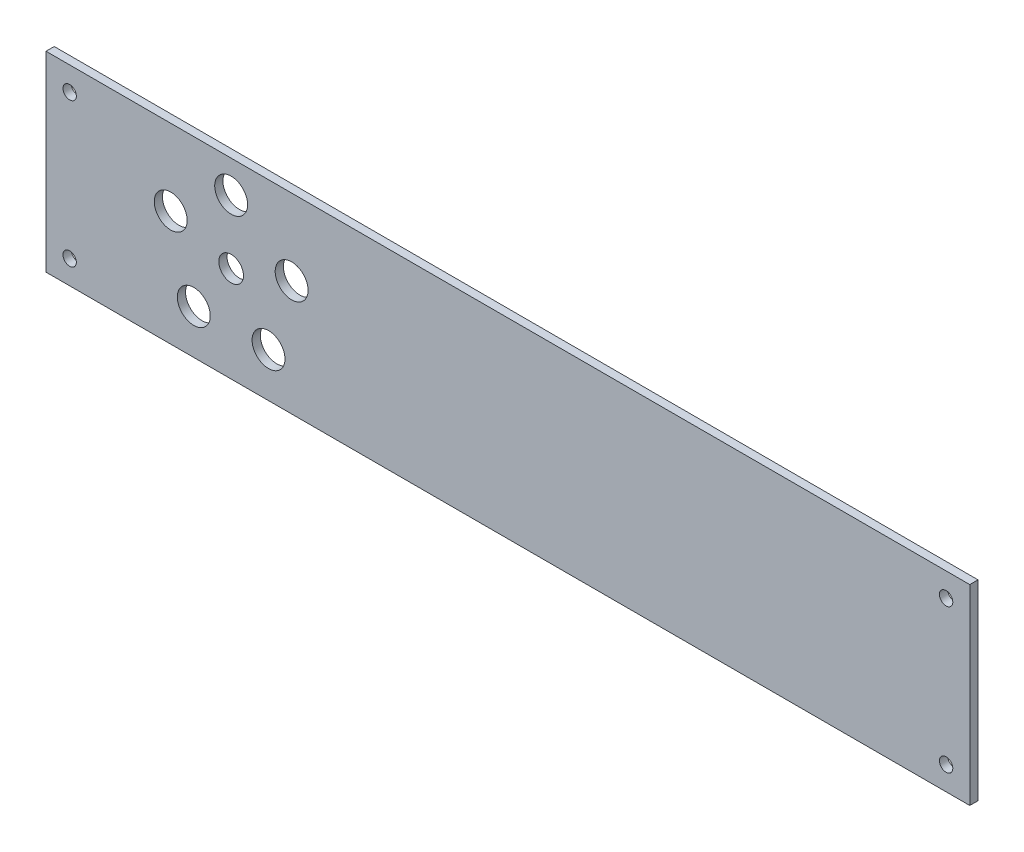
ISO-10303-21;
HEADER;
FILE_DESCRIPTION(('STEP AP214'),'2;1');
FILE_NAME('part.step','',(''),(''),'','','');
FILE_SCHEMA(('AUTOMOTIVE_DESIGN { 1 0 10303 214 1 1 1 1 }'));
ENDSEC;
DATA;
#1=APPLICATION_CONTEXT('core data for automotive mechanical design processes');
#2=APPLICATION_PROTOCOL_DEFINITION('international standard','automotive_design',2000,#1);
#3=PRODUCT_CONTEXT('',#1,'mechanical');
#4=PRODUCT('Part','Part','',(#3));
#5=PRODUCT_RELATED_PRODUCT_CATEGORY('part','',(#4));
#6=PRODUCT_DEFINITION_FORMATION('','',#4);
#7=PRODUCT_DEFINITION_CONTEXT('part definition',#1,'design');
#8=PRODUCT_DEFINITION('design','',#6,#7);
#9=PRODUCT_DEFINITION_SHAPE('','',#8);
#10=(LENGTH_UNIT() NAMED_UNIT(*) SI_UNIT(.MILLI.,.METRE.));
#11=(NAMED_UNIT(*) PLANE_ANGLE_UNIT() SI_UNIT($,.RADIAN.));
#12=(NAMED_UNIT(*) SI_UNIT($,.STERADIAN.) SOLID_ANGLE_UNIT());
#13=UNCERTAINTY_MEASURE_WITH_UNIT(LENGTH_MEASURE(1.E-05),#10,'distance_accuracy_value','');
#14=(GEOMETRIC_REPRESENTATION_CONTEXT(3) GLOBAL_UNCERTAINTY_ASSIGNED_CONTEXT((#13)) GLOBAL_UNIT_ASSIGNED_CONTEXT((#10,
#11,#12)) REPRESENTATION_CONTEXT('',''));
#15=CARTESIAN_POINT('',(0.,0.,0.));
#16=DIRECTION('',(0.,0.,1.));
#17=DIRECTION('',(1.,0.,0.));
#18=AXIS2_PLACEMENT_3D('',#15,#16,#17);
#19=CARTESIAN_POINT('',(0.,0.,4.));
#20=DIRECTION('',(0.,0.,1.));
#21=DIRECTION('',(1.,0.,0.));
#22=AXIS2_PLACEMENT_3D('',#19,#20,#21);
#23=PLANE('',#22);
#24=CARTESIAN_POINT('',(-377.163563200134,21.4999999999999,4.));
#25=DIRECTION('',(0.,0.,1.));
#26=DIRECTION('',(1.,0.,0.));
#27=AXIS2_PLACEMENT_3D('',#24,#25,#26);
#28=CIRCLE('',#27,7.99999999999998);
#29=CARTESIAN_POINT('',(-369.163563200134,21.4999999999999,4.));
#30=VERTEX_POINT('',#29);
#31=EDGE_CURVE('E211',#30,#30,#28,.T.);
#32=ORIENTED_EDGE('',*,*,#31,.F.);
#33=EDGE_LOOP('',(#32));
#34=FACE_BOUND('',#33,.T.);
#35=CARTESIAN_POINT('',(-329.610737385376,56.0491502812527,4.));
#36=DIRECTION('',(0.,0.,1.));
#37=DIRECTION('',(1.,0.,0.));
#38=AXIS2_PLACEMENT_3D('',#35,#36,#37);
#39=CIRCLE('',#38,7.99999999999998);
#40=CARTESIAN_POINT('',(-321.610737385376,56.0491502812527,4.));
#41=VERTEX_POINT('',#40);
#42=EDGE_CURVE('E240',#41,#41,#39,.T.);
#43=ORIENTED_EDGE('',*,*,#42,.F.);
#44=EDGE_LOOP('',(#43));
#45=FACE_BOUND('',#44,.T.);
#46=CARTESIAN_POINT('',(-11.5,11.5000000000001,4.));
#47=DIRECTION('',(0.,0.,1.));
#48=DIRECTION('',(1.,0.,0.));
#49=AXIS2_PLACEMENT_3D('',#46,#47,#48);
#50=CIRCLE('',#49,3.25);
#51=CARTESIAN_POINT('',(-8.24999999999996,11.5000000000001,4.));
#52=VERTEX_POINT('',#51);
#53=EDGE_CURVE('E191',#52,#52,#50,.T.);
#54=ORIENTED_EDGE('',*,*,#53,.F.);
#55=EDGE_LOOP('',(#54));
#56=FACE_BOUND('',#55,.T.);
#57=CARTESIAN_POINT('',(-359.,77.4016994374947,4.));
#58=DIRECTION('',(0.,0.,1.));
#59=DIRECTION('',(1.,0.,0.));
#60=AXIS2_PLACEMENT_3D('',#57,#58,#59);
#61=CIRCLE('',#60,7.99999999999999);
#62=CARTESIAN_POINT('',(-351.,77.4016994374947,4.));
#63=VERTEX_POINT('',#62);
#64=EDGE_CURVE('E437',#63,#63,#61,.T.);
#65=ORIENTED_EDGE('',*,*,#64,.F.);
#66=EDGE_LOOP('',(#65));
#67=FACE_BOUND('',#66,.T.);
#68=CARTESIAN_POINT('',(-437.5,81.4999999999999,4.));
#69=DIRECTION('',(0.,0.,1.));
#70=DIRECTION('',(1.,0.,0.));
#71=AXIS2_PLACEMENT_3D('',#68,#69,#70);
#72=CIRCLE('',#71,3.24999999999995);
#73=CARTESIAN_POINT('',(-434.25,81.4999999999999,4.));
#74=VERTEX_POINT('',#73);
#75=EDGE_CURVE('E117',#74,#74,#72,.T.);
#76=ORIENTED_EDGE('',*,*,#75,.F.);
#77=EDGE_LOOP('',(#76));
#78=FACE_BOUND('',#77,.T.);
#79=DIRECTION('',(0.,1.,0.));
#80=VECTOR('',#79,1.);
#81=CARTESIAN_POINT('',(0.,0.,4.));
#82=LINE('',#81,#80);
#83=CARTESIAN_POINT('',(0.,0.,4.));
#84=VERTEX_POINT('',#83);
#85=CARTESIAN_POINT('',(0.,92.9999999999999,4.));
#86=VERTEX_POINT('',#85);
#87=EDGE_CURVE('E97',#84,#86,#82,.T.);
#88=ORIENTED_EDGE('',*,*,#87,.T.);
#89=DIRECTION('',(-1.,0.,0.));
#90=VECTOR('',#89,1.);
#91=CARTESIAN_POINT('',(0.,92.9999999999999,4.));
#92=LINE('',#91,#90);
#93=CARTESIAN_POINT('',(-449.,92.9999999999999,4.));
#94=VERTEX_POINT('',#93);
#95=EDGE_CURVE('E92',#86,#94,#92,.T.);
#96=ORIENTED_EDGE('',*,*,#95,.T.);
#97=DIRECTION('',(0.,-1.,0.));
#98=VECTOR('',#97,1.);
#99=CARTESIAN_POINT('',(-449.,0.,4.));
#100=LINE('',#99,#98);
#101=CARTESIAN_POINT('',(-449.,0.,4.));
#102=VERTEX_POINT('',#101);
#103=EDGE_CURVE('E95',#94,#102,#100,.T.);
#104=ORIENTED_EDGE('',*,*,#103,.T.);
#105=DIRECTION('',(1.,0.,0.));
#106=VECTOR('',#105,1.);
#107=CARTESIAN_POINT('',(0.,0.,4.));
#108=LINE('',#107,#106);
#109=EDGE_CURVE('E61',#102,#84,#108,.T.);
#110=ORIENTED_EDGE('',*,*,#109,.T.);
#111=EDGE_LOOP('',(#88,#96,#104,#110));
#112=FACE_BOUND('',#111,.T.);
#113=CARTESIAN_POINT('',(-388.389262614624,56.0491502812526,4.));
#114=DIRECTION('',(0.,0.,1.));
#115=DIRECTION('',(1.,0.,0.));
#116=AXIS2_PLACEMENT_3D('',#113,#114,#115);
#117=CIRCLE('',#116,7.99999999999998);
#118=CARTESIAN_POINT('',(-380.389262614624,56.0491502812526,4.));
#119=VERTEX_POINT('',#118);
#120=EDGE_CURVE('E139',#119,#119,#117,.T.);
#121=ORIENTED_EDGE('',*,*,#120,.F.);
#122=EDGE_LOOP('',(#121));
#123=FACE_BOUND('',#122,.T.);
#124=CARTESIAN_POINT('',(-11.5,81.4999999999998,4.));
#125=DIRECTION('',(0.,0.,1.));
#126=DIRECTION('',(-1.,0.,0.));
#127=AXIS2_PLACEMENT_3D('',#124,#125,#126);
#128=CIRCLE('',#127,3.25);
#129=CARTESIAN_POINT('',(-14.75,81.4999999999998,4.));
#130=VERTEX_POINT('',#129);
#131=EDGE_CURVE('E178',#130,#130,#128,.T.);
#132=ORIENTED_EDGE('',*,*,#131,.F.);
#133=EDGE_LOOP('',(#132));
#134=FACE_BOUND('',#133,.T.);
#135=CARTESIAN_POINT('',(-437.5,11.4999999999999,4.));
#136=DIRECTION('',(0.,0.,1.));
#137=DIRECTION('',(-1.,0.,0.));
#138=AXIS2_PLACEMENT_3D('',#135,#136,#137);
#139=CIRCLE('',#138,3.24999999999995);
#140=CARTESIAN_POINT('',(-440.75,11.4999999999999,4.));
#141=VERTEX_POINT('',#140);
#142=EDGE_CURVE('E159',#141,#141,#139,.T.);
#143=ORIENTED_EDGE('',*,*,#142,.F.);
#144=EDGE_LOOP('',(#143));
#145=FACE_BOUND('',#144,.T.);
#146=CARTESIAN_POINT('',(-340.836436799866,21.5,4.));
#147=DIRECTION('',(0.,0.,1.));
#148=DIRECTION('',(1.,0.,0.));
#149=AXIS2_PLACEMENT_3D('',#146,#147,#148);
#150=CIRCLE('',#149,8.00000000000003);
#151=CARTESIAN_POINT('',(-332.836436799866,21.5,4.));
#152=VERTEX_POINT('',#151);
#153=EDGE_CURVE('E225',#152,#152,#150,.T.);
#154=ORIENTED_EDGE('',*,*,#153,.F.);
#155=EDGE_LOOP('',(#154));
#156=FACE_BOUND('',#155,.T.);
#157=CARTESIAN_POINT('',(-359.,46.4999999999999,4.));
#158=DIRECTION('',(0.,0.,1.));
#159=DIRECTION('',(1.,0.,0.));
#160=AXIS2_PLACEMENT_3D('',#157,#158,#159);
#161=CIRCLE('',#160,5.99999999999999);
#162=CARTESIAN_POINT('',(-353.,46.4999999999999,4.));
#163=VERTEX_POINT('',#162);
#164=EDGE_CURVE('E234',#163,#163,#161,.T.);
#165=ORIENTED_EDGE('',*,*,#164,.F.);
#166=EDGE_LOOP('',(#165));
#167=FACE_BOUND('',#166,.T.);
#168=ADVANCED_FACE('F43',(#34,#45,#56,#67,#78,#112,#123,#134,#145,#156,#167),#23,.T.);
#169=CARTESIAN_POINT('',(0.,0.,0.));
#170=DIRECTION('',(0.,0.,1.));
#171=DIRECTION('',(1.,0.,0.));
#172=AXIS2_PLACEMENT_3D('',#169,#170,#171);
#173=PLANE('',#172);
#174=DIRECTION('',(0.,1.,0.));
#175=VECTOR('',#174,1.);
#176=CARTESIAN_POINT('',(0.,0.,0.));
#177=LINE('',#176,#175);
#178=CARTESIAN_POINT('',(0.,0.,0.));
#179=VERTEX_POINT('',#178);
#180=CARTESIAN_POINT('',(0.,92.9999999999999,0.));
#181=VERTEX_POINT('',#180);
#182=EDGE_CURVE('E113',#179,#181,#177,.T.);
#183=ORIENTED_EDGE('',*,*,#182,.F.);
#184=DIRECTION('',(1.,0.,0.));
#185=VECTOR('',#184,1.);
#186=CARTESIAN_POINT('',(0.,0.,0.));
#187=LINE('',#186,#185);
#188=CARTESIAN_POINT('',(-449.,0.,0.));
#189=VERTEX_POINT('',#188);
#190=EDGE_CURVE('E85',#189,#179,#187,.T.);
#191=ORIENTED_EDGE('',*,*,#190,.F.);
#192=DIRECTION('',(0.,-1.,0.));
#193=VECTOR('',#192,1.);
#194=CARTESIAN_POINT('',(-449.,0.,0.));
#195=LINE('',#194,#193);
#196=CARTESIAN_POINT('',(-449.,92.9999999999999,0.));
#197=VERTEX_POINT('',#196);
#198=EDGE_CURVE('E79',#197,#189,#195,.T.);
#199=ORIENTED_EDGE('',*,*,#198,.F.);
#200=DIRECTION('',(-1.,0.,0.));
#201=VECTOR('',#200,1.);
#202=CARTESIAN_POINT('',(0.,92.9999999999999,0.));
#203=LINE('',#202,#201);
#204=EDGE_CURVE('E102',#181,#197,#203,.T.);
#205=ORIENTED_EDGE('',*,*,#204,.F.);
#206=EDGE_LOOP('',(#183,#191,#199,#205));
#207=FACE_BOUND('',#206,.T.);
#208=CARTESIAN_POINT('',(-437.5,81.4999999999999,0.));
#209=DIRECTION('',(0.,0.,1.));
#210=DIRECTION('',(1.,0.,0.));
#211=AXIS2_PLACEMENT_3D('',#208,#209,#210);
#212=CIRCLE('',#211,3.24999999999995);
#213=CARTESIAN_POINT('',(-434.25,81.4999999999999,0.));
#214=VERTEX_POINT('',#213);
#215=EDGE_CURVE('E135',#214,#214,#212,.T.);
#216=ORIENTED_EDGE('',*,*,#215,.T.);
#217=EDGE_LOOP('',(#216));
#218=FACE_BOUND('',#217,.T.);
#219=CARTESIAN_POINT('',(-388.389262614624,56.0491502812526,0.));
#220=DIRECTION('',(0.,0.,1.));
#221=DIRECTION('',(1.,0.,0.));
#222=AXIS2_PLACEMENT_3D('',#219,#220,#221);
#223=CIRCLE('',#222,7.99999999999998);
#224=CARTESIAN_POINT('',(-380.389262614624,56.0491502812526,0.));
#225=VERTEX_POINT('',#224);
#226=EDGE_CURVE('E144',#225,#225,#223,.T.);
#227=ORIENTED_EDGE('',*,*,#226,.T.);
#228=EDGE_LOOP('',(#227));
#229=FACE_BOUND('',#228,.T.);
#230=CARTESIAN_POINT('',(-359.,77.4016994374947,0.));
#231=DIRECTION('',(0.,0.,1.));
#232=DIRECTION('',(1.,0.,0.));
#233=AXIS2_PLACEMENT_3D('',#230,#231,#232);
#234=CIRCLE('',#233,7.99999999999999);
#235=CARTESIAN_POINT('',(-351.,77.4016994374947,0.));
#236=VERTEX_POINT('',#235);
#237=EDGE_CURVE('E184',#236,#236,#234,.T.);
#238=ORIENTED_EDGE('',*,*,#237,.T.);
#239=EDGE_LOOP('',(#238));
#240=FACE_BOUND('',#239,.T.);
#241=CARTESIAN_POINT('',(-11.5,81.4999999999998,0.));
#242=DIRECTION('',(0.,0.,1.));
#243=DIRECTION('',(-1.,0.,0.));
#244=AXIS2_PLACEMENT_3D('',#241,#242,#243);
#245=CIRCLE('',#244,3.25);
#246=CARTESIAN_POINT('',(-14.75,81.4999999999998,0.));
#247=VERTEX_POINT('',#246);
#248=EDGE_CURVE('E185',#247,#247,#245,.T.);
#249=ORIENTED_EDGE('',*,*,#248,.T.);
#250=EDGE_LOOP('',(#249));
#251=FACE_BOUND('',#250,.T.);
#252=CARTESIAN_POINT('',(-11.5,11.5000000000001,0.));
#253=DIRECTION('',(0.,0.,1.));
#254=DIRECTION('',(1.,0.,0.));
#255=AXIS2_PLACEMENT_3D('',#252,#253,#254);
#256=CIRCLE('',#255,3.25);
#257=CARTESIAN_POINT('',(-8.24999999999996,11.5000000000001,0.));
#258=VERTEX_POINT('',#257);
#259=EDGE_CURVE('E165',#258,#258,#256,.T.);
#260=ORIENTED_EDGE('',*,*,#259,.T.);
#261=EDGE_LOOP('',(#260));
#262=FACE_BOUND('',#261,.T.);
#263=CARTESIAN_POINT('',(-437.5,11.4999999999999,0.));
#264=DIRECTION('',(0.,0.,1.));
#265=DIRECTION('',(-1.,0.,0.));
#266=AXIS2_PLACEMENT_3D('',#263,#264,#265);
#267=CIRCLE('',#266,3.24999999999995);
#268=CARTESIAN_POINT('',(-440.75,11.4999999999999,0.));
#269=VERTEX_POINT('',#268);
#270=EDGE_CURVE('E166',#269,#269,#267,.T.);
#271=ORIENTED_EDGE('',*,*,#270,.T.);
#272=EDGE_LOOP('',(#271));
#273=FACE_BOUND('',#272,.T.);
#274=CARTESIAN_POINT('',(-329.610737385376,56.0491502812527,0.));
#275=DIRECTION('',(0.,0.,1.));
#276=DIRECTION('',(1.,0.,0.));
#277=AXIS2_PLACEMENT_3D('',#274,#275,#276);
#278=CIRCLE('',#277,7.99999999999998);
#279=CARTESIAN_POINT('',(-321.610737385376,56.0491502812527,0.));
#280=VERTEX_POINT('',#279);
#281=EDGE_CURVE('E167',#280,#280,#278,.T.);
#282=ORIENTED_EDGE('',*,*,#281,.T.);
#283=EDGE_LOOP('',(#282));
#284=FACE_BOUND('',#283,.T.);
#285=CARTESIAN_POINT('',(-340.836436799866,21.5,0.));
#286=DIRECTION('',(0.,0.,1.));
#287=DIRECTION('',(1.,0.,0.));
#288=AXIS2_PLACEMENT_3D('',#285,#286,#287);
#289=CIRCLE('',#288,8.00000000000003);
#290=CARTESIAN_POINT('',(-332.836436799866,21.5,0.));
#291=VERTEX_POINT('',#290);
#292=EDGE_CURVE('E217',#291,#291,#289,.T.);
#293=ORIENTED_EDGE('',*,*,#292,.T.);
#294=EDGE_LOOP('',(#293));
#295=FACE_BOUND('',#294,.T.);
#296=CARTESIAN_POINT('',(-377.163563200134,21.4999999999999,0.));
#297=DIRECTION('',(0.,0.,1.));
#298=DIRECTION('',(1.,0.,0.));
#299=AXIS2_PLACEMENT_3D('',#296,#297,#298);
#300=CIRCLE('',#299,7.99999999999998);
#301=CARTESIAN_POINT('',(-369.163563200134,21.4999999999999,0.));
#302=VERTEX_POINT('',#301);
#303=EDGE_CURVE('E218',#302,#302,#300,.T.);
#304=ORIENTED_EDGE('',*,*,#303,.T.);
#305=EDGE_LOOP('',(#304));
#306=FACE_BOUND('',#305,.T.);
#307=CARTESIAN_POINT('',(-359.,46.4999999999999,0.));
#308=DIRECTION('',(0.,0.,1.));
#309=DIRECTION('',(1.,0.,0.));
#310=AXIS2_PLACEMENT_3D('',#307,#308,#309);
#311=CIRCLE('',#310,5.99999999999999);
#312=CARTESIAN_POINT('',(-353.,46.4999999999999,0.));
#313=VERTEX_POINT('',#312);
#314=EDGE_CURVE('E219',#313,#313,#311,.T.);
#315=ORIENTED_EDGE('',*,*,#314,.T.);
#316=EDGE_LOOP('',(#315));
#317=FACE_BOUND('',#316,.T.);
#318=ADVANCED_FACE('F130',(#207,#218,#229,#240,#251,#262,#273,#284,#295,#306,#317),#173,.F.);
#319=CARTESIAN_POINT('',(0.,0.,4.));
#320=DIRECTION('',(-1.,0.,0.));
#321=DIRECTION('',(0.,0.,1.));
#322=AXIS2_PLACEMENT_3D('',#319,#320,#321);
#323=PLANE('',#322);
#324=ORIENTED_EDGE('',*,*,#182,.T.);
#325=DIRECTION('',(0.,0.,-1.));
#326=VECTOR('',#325,1.);
#327=CARTESIAN_POINT('',(0.,92.9999999999999,4.));
#328=LINE('',#327,#326);
#329=EDGE_CURVE('E12',#86,#181,#328,.T.);
#330=ORIENTED_EDGE('',*,*,#329,.F.);
#331=ORIENTED_EDGE('',*,*,#87,.F.);
#332=DIRECTION('',(0.,0.,-1.));
#333=VECTOR('',#332,1.);
#334=CARTESIAN_POINT('',(0.,0.,4.));
#335=LINE('',#334,#333);
#336=EDGE_CURVE('E109',#84,#179,#335,.T.);
#337=ORIENTED_EDGE('',*,*,#336,.T.);
#338=EDGE_LOOP('',(#324,#330,#331,#337));
#339=FACE_BOUND('',#338,.T.);
#340=ADVANCED_FACE('F45',(#339),#323,.F.);
#341=CARTESIAN_POINT('',(0.,92.9999999999999,4.));
#342=DIRECTION('',(0.,-1.,0.));
#343=DIRECTION('',(1.,0.,0.));
#344=AXIS2_PLACEMENT_3D('',#341,#342,#343);
#345=PLANE('',#344);
#346=ORIENTED_EDGE('',*,*,#204,.T.);
#347=DIRECTION('',(0.,0.,-1.));
#348=VECTOR('',#347,1.);
#349=CARTESIAN_POINT('',(-449.,92.9999999999999,4.));
#350=LINE('',#349,#348);
#351=EDGE_CURVE('E53',#94,#197,#350,.T.);
#352=ORIENTED_EDGE('',*,*,#351,.F.);
#353=ORIENTED_EDGE('',*,*,#95,.F.);
#354=ORIENTED_EDGE('',*,*,#329,.T.);
#355=EDGE_LOOP('',(#346,#352,#353,#354));
#356=FACE_BOUND('',#355,.T.);
#357=ADVANCED_FACE('F101',(#356),#345,.F.);
#358=CARTESIAN_POINT('',(-449.,0.,4.));
#359=DIRECTION('',(1.,0.,0.));
#360=DIRECTION('',(0.,1.,0.));
#361=AXIS2_PLACEMENT_3D('',#358,#359,#360);
#362=PLANE('',#361);
#363=ORIENTED_EDGE('',*,*,#198,.T.);
#364=DIRECTION('',(0.,0.,-1.));
#365=VECTOR('',#364,1.);
#366=CARTESIAN_POINT('',(-449.,0.,4.));
#367=LINE('',#366,#365);
#368=EDGE_CURVE('E104',#102,#189,#367,.T.);
#369=ORIENTED_EDGE('',*,*,#368,.F.);
#370=ORIENTED_EDGE('',*,*,#103,.F.);
#371=ORIENTED_EDGE('',*,*,#351,.T.);
#372=EDGE_LOOP('',(#363,#369,#370,#371));
#373=FACE_BOUND('',#372,.T.);
#374=ADVANCED_FACE('F105',(#373),#362,.F.);
#375=CARTESIAN_POINT('',(0.,0.,4.));
#376=DIRECTION('',(0.,1.,0.));
#377=DIRECTION('',(-1.,0.,0.));
#378=AXIS2_PLACEMENT_3D('',#375,#376,#377);
#379=PLANE('',#378);
#380=ORIENTED_EDGE('',*,*,#190,.T.);
#381=ORIENTED_EDGE('',*,*,#336,.F.);
#382=ORIENTED_EDGE('',*,*,#109,.F.);
#383=ORIENTED_EDGE('',*,*,#368,.T.);
#384=EDGE_LOOP('',(#380,#381,#382,#383));
#385=FACE_BOUND('',#384,.T.);
#386=ADVANCED_FACE('F127',(#385),#379,.F.);
#387=CARTESIAN_POINT('',(-437.5,81.4999999999999,4.));
#388=DIRECTION('',(0.,0.,-1.));
#389=DIRECTION('',(-1.,0.,0.));
#390=AXIS2_PLACEMENT_3D('',#387,#388,#389);
#391=CYLINDRICAL_SURFACE('',#390,3.24999999999995);
#392=ORIENTED_EDGE('',*,*,#75,.T.);
#393=EDGE_LOOP('',(#392));
#394=FACE_BOUND('',#393,.T.);
#395=ORIENTED_EDGE('',*,*,#215,.F.);
#396=EDGE_LOOP('',(#395));
#397=FACE_BOUND('',#396,.T.);
#398=ADVANCED_FACE('F283',(#394,#397),#391,.F.);
#399=CARTESIAN_POINT('',(-388.389262614624,56.0491502812526,4.));
#400=DIRECTION('',(0.,0.,-1.));
#401=DIRECTION('',(-1.,0.,0.));
#402=AXIS2_PLACEMENT_3D('',#399,#400,#401);
#403=CYLINDRICAL_SURFACE('',#402,7.99999999999998);
#404=ORIENTED_EDGE('',*,*,#120,.T.);
#405=EDGE_LOOP('',(#404));
#406=FACE_BOUND('',#405,.T.);
#407=ORIENTED_EDGE('',*,*,#226,.F.);
#408=EDGE_LOOP('',(#407));
#409=FACE_BOUND('',#408,.T.);
#410=ADVANCED_FACE('F334',(#406,#409),#403,.F.);
#411=CARTESIAN_POINT('',(-359.,77.4016994374947,4.));
#412=DIRECTION('',(0.,0.,-1.));
#413=DIRECTION('',(-1.,0.,0.));
#414=AXIS2_PLACEMENT_3D('',#411,#412,#413);
#415=CYLINDRICAL_SURFACE('',#414,7.99999999999999);
#416=ORIENTED_EDGE('',*,*,#64,.T.);
#417=EDGE_LOOP('',(#416));
#418=FACE_BOUND('',#417,.T.);
#419=ORIENTED_EDGE('',*,*,#237,.F.);
#420=EDGE_LOOP('',(#419));
#421=FACE_BOUND('',#420,.T.);
#422=ADVANCED_FACE('F342',(#418,#421),#415,.F.);
#423=CARTESIAN_POINT('',(-11.5,81.4999999999998,4.));
#424=DIRECTION('',(0.,0.,-1.));
#425=DIRECTION('',(-1.,0.,0.));
#426=AXIS2_PLACEMENT_3D('',#423,#424,#425);
#427=CYLINDRICAL_SURFACE('',#426,3.25);
#428=ORIENTED_EDGE('',*,*,#131,.T.);
#429=EDGE_LOOP('',(#428));
#430=FACE_BOUND('',#429,.T.);
#431=ORIENTED_EDGE('',*,*,#248,.F.);
#432=EDGE_LOOP('',(#431));
#433=FACE_BOUND('',#432,.T.);
#434=ADVANCED_FACE('F350',(#430,#433),#427,.F.);
#435=CARTESIAN_POINT('',(-11.5,11.5000000000001,4.));
#436=DIRECTION('',(0.,0.,-1.));
#437=DIRECTION('',(-1.,0.,0.));
#438=AXIS2_PLACEMENT_3D('',#435,#436,#437);
#439=CYLINDRICAL_SURFACE('',#438,3.25);
#440=ORIENTED_EDGE('',*,*,#53,.T.);
#441=EDGE_LOOP('',(#440));
#442=FACE_BOUND('',#441,.T.);
#443=ORIENTED_EDGE('',*,*,#259,.F.);
#444=EDGE_LOOP('',(#443));
#445=FACE_BOUND('',#444,.T.);
#446=ADVANCED_FACE('F270',(#442,#445),#439,.F.);
#447=CARTESIAN_POINT('',(-437.5,11.4999999999999,4.));
#448=DIRECTION('',(0.,0.,-1.));
#449=DIRECTION('',(-1.,0.,0.));
#450=AXIS2_PLACEMENT_3D('',#447,#448,#449);
#451=CYLINDRICAL_SURFACE('',#450,3.24999999999995);
#452=ORIENTED_EDGE('',*,*,#142,.T.);
#453=EDGE_LOOP('',(#452));
#454=FACE_BOUND('',#453,.T.);
#455=ORIENTED_EDGE('',*,*,#270,.F.);
#456=EDGE_LOOP('',(#455));
#457=FACE_BOUND('',#456,.T.);
#458=ADVANCED_FACE('F261',(#454,#457),#451,.F.);
#459=CARTESIAN_POINT('',(-329.610737385376,56.0491502812527,4.));
#460=DIRECTION('',(0.,0.,-1.));
#461=DIRECTION('',(-1.,0.,0.));
#462=AXIS2_PLACEMENT_3D('',#459,#460,#461);
#463=CYLINDRICAL_SURFACE('',#462,7.99999999999998);
#464=ORIENTED_EDGE('',*,*,#42,.T.);
#465=EDGE_LOOP('',(#464));
#466=FACE_BOUND('',#465,.T.);
#467=ORIENTED_EDGE('',*,*,#281,.F.);
#468=EDGE_LOOP('',(#467));
#469=FACE_BOUND('',#468,.T.);
#470=ADVANCED_FACE('F258',(#466,#469),#463,.F.);
#471=CARTESIAN_POINT('',(-340.836436799866,21.5,4.));
#472=DIRECTION('',(0.,0.,-1.));
#473=DIRECTION('',(-1.,0.,0.));
#474=AXIS2_PLACEMENT_3D('',#471,#472,#473);
#475=CYLINDRICAL_SURFACE('',#474,8.00000000000003);
#476=ORIENTED_EDGE('',*,*,#153,.T.);
#477=EDGE_LOOP('',(#476));
#478=FACE_BOUND('',#477,.T.);
#479=ORIENTED_EDGE('',*,*,#292,.F.);
#480=EDGE_LOOP('',(#479));
#481=FACE_BOUND('',#480,.T.);
#482=ADVANCED_FACE('F260',(#478,#481),#475,.F.);
#483=CARTESIAN_POINT('',(-377.163563200134,21.4999999999999,4.));
#484=DIRECTION('',(0.,0.,-1.));
#485=DIRECTION('',(-1.,0.,0.));
#486=AXIS2_PLACEMENT_3D('',#483,#484,#485);
#487=CYLINDRICAL_SURFACE('',#486,7.99999999999998);
#488=ORIENTED_EDGE('',*,*,#31,.T.);
#489=EDGE_LOOP('',(#488));
#490=FACE_BOUND('',#489,.T.);
#491=ORIENTED_EDGE('',*,*,#303,.F.);
#492=EDGE_LOOP('',(#491));
#493=FACE_BOUND('',#492,.T.);
#494=ADVANCED_FACE('F267',(#490,#493),#487,.F.);
#495=CARTESIAN_POINT('',(-359.,46.4999999999999,4.));
#496=DIRECTION('',(0.,0.,-1.));
#497=DIRECTION('',(-1.,0.,0.));
#498=AXIS2_PLACEMENT_3D('',#495,#496,#497);
#499=CYLINDRICAL_SURFACE('',#498,5.99999999999999);
#500=ORIENTED_EDGE('',*,*,#164,.T.);
#501=EDGE_LOOP('',(#500));
#502=FACE_BOUND('',#501,.T.);
#503=ORIENTED_EDGE('',*,*,#314,.F.);
#504=EDGE_LOOP('',(#503));
#505=FACE_BOUND('',#504,.T.);
#506=ADVANCED_FACE('F389',(#502,#505),#499,.F.);
#507=CLOSED_SHELL('',(#168,#318,#340,#357,#374,#386,#398,#410,#422,#434,#446,#458,#470,#482,
#494,#506));
#508=MANIFOLD_SOLID_BREP('B2',#507);
#509=ADVANCED_BREP_SHAPE_REPRESENTATION('',(#18,#508),#14);
#510=SHAPE_DEFINITION_REPRESENTATION(#9,#509);
ENDSEC;
END-ISO-10303-21;
